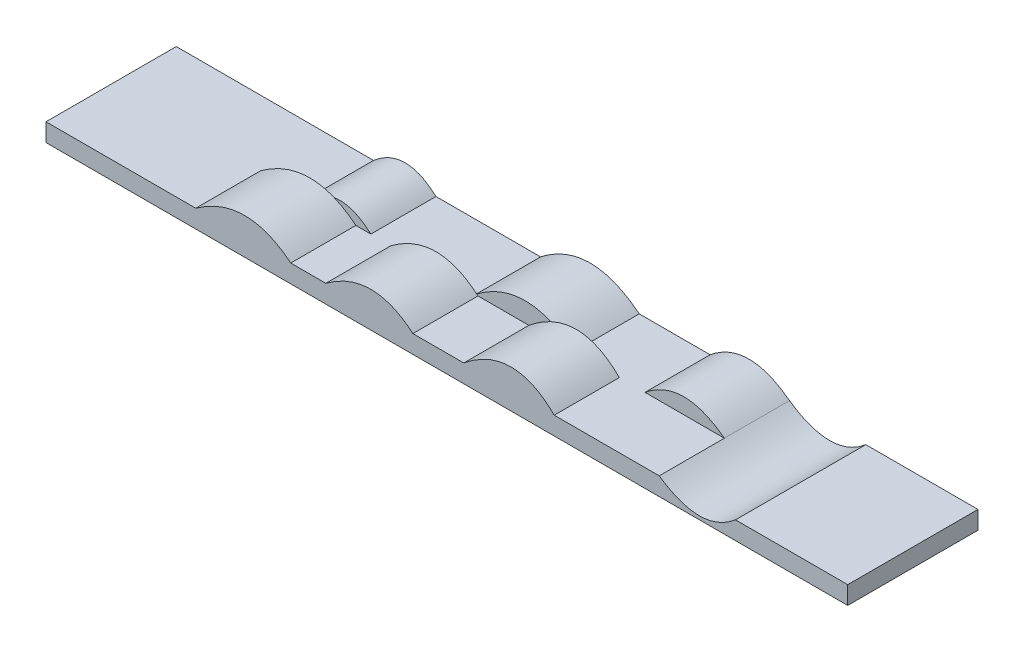
ISO-10303-21;
HEADER;
FILE_DESCRIPTION(('STEP AP214'),'2;1');
FILE_NAME('part.step','',(''),(''),'','','');
FILE_SCHEMA(('AUTOMOTIVE_DESIGN { 1 0 10303 214 1 1 1 1 }'));
ENDSEC;
DATA;
#1=APPLICATION_CONTEXT('core data for automotive mechanical design processes');
#2=APPLICATION_PROTOCOL_DEFINITION('international standard','automotive_design',2000,#1);
#3=PRODUCT_CONTEXT('',#1,'mechanical');
#4=PRODUCT('Part','Part','',(#3));
#5=PRODUCT_RELATED_PRODUCT_CATEGORY('part','',(#4));
#6=PRODUCT_DEFINITION_FORMATION('','',#4);
#7=PRODUCT_DEFINITION_CONTEXT('part definition',#1,'design');
#8=PRODUCT_DEFINITION('design','',#6,#7);
#9=PRODUCT_DEFINITION_SHAPE('','',#8);
#10=(LENGTH_UNIT() NAMED_UNIT(*) SI_UNIT(.MILLI.,.METRE.));
#11=(NAMED_UNIT(*) PLANE_ANGLE_UNIT() SI_UNIT($,.RADIAN.));
#12=(NAMED_UNIT(*) SI_UNIT($,.STERADIAN.) SOLID_ANGLE_UNIT());
#13=UNCERTAINTY_MEASURE_WITH_UNIT(LENGTH_MEASURE(1.E-05),#10,'distance_accuracy_value','');
#14=(GEOMETRIC_REPRESENTATION_CONTEXT(3) GLOBAL_UNCERTAINTY_ASSIGNED_CONTEXT((#13)) GLOBAL_UNIT_ASSIGNED_CONTEXT((#10,
#11,#12)) REPRESENTATION_CONTEXT('',''));
#15=CARTESIAN_POINT('',(0.,0.,0.));
#16=DIRECTION('',(0.,0.,1.));
#17=DIRECTION('',(1.,0.,0.));
#18=AXIS2_PLACEMENT_3D('',#15,#16,#17);
#19=CARTESIAN_POINT('',(0.,90.,0.));
#20=DIRECTION('',(0.,-1.,0.));
#21=DIRECTION('',(0.,0.,-1.));
#22=AXIS2_PLACEMENT_3D('',#19,#20,#21);
#23=PLANE('',#22);
#24=DIRECTION('',(-1.,0.,0.));
#25=VECTOR('',#24,1.);
#26=CARTESIAN_POINT('',(-2000.,90.,-325.));
#27=LINE('',#26,#25);
#28=CARTESIAN_POINT('',(2000.,90.,-325.));
#29=VERTEX_POINT('',#28);
#30=CARTESIAN_POINT('',(1440.18100709892,90.,-325.));
#31=VERTEX_POINT('',#30);
#32=EDGE_CURVE('E186',#29,#31,#27,.T.);
#33=ORIENTED_EDGE('',*,*,#32,.T.);
#34=DIRECTION('',(0.,0.,-1.));
#35=VECTOR('',#34,1.);
#36=CARTESIAN_POINT('',(1440.18100709892,90.,775.));
#37=LINE('',#36,#35);
#38=CARTESIAN_POINT('',(1440.18100709892,90.,325.));
#39=VERTEX_POINT('',#38);
#40=EDGE_CURVE('E170',#39,#31,#37,.T.);
#41=ORIENTED_EDGE('',*,*,#40,.F.);
#42=DIRECTION('',(1.,0.,0.));
#43=VECTOR('',#42,1.);
#44=CARTESIAN_POINT('',(-2000.,90.,325.));
#45=LINE('',#44,#43);
#46=CARTESIAN_POINT('',(2000.,90.,325.));
#47=VERTEX_POINT('',#46);
#48=EDGE_CURVE('E198',#39,#47,#45,.T.);
#49=ORIENTED_EDGE('',*,*,#48,.T.);
#50=DIRECTION('',(0.,0.,-1.));
#51=VECTOR('',#50,1.);
#52=CARTESIAN_POINT('',(2000.,90.,325.));
#53=LINE('',#52,#51);
#54=EDGE_CURVE('E192',#47,#29,#53,.T.);
#55=ORIENTED_EDGE('',*,*,#54,.T.);
#56=EDGE_LOOP('',(#33,#41,#49,#55));
#57=FACE_BOUND('',#56,.T.);
#58=ADVANCED_FACE('F36',(#57),#23,.F.);
#59=DIRECTION('',(0.,0.,-1.));
#60=VECTOR('',#59,1.);
#61=CARTESIAN_POINT('',(-1015.92929456039,90.,0.));
#62=LINE('',#61,#60);
#63=CARTESIAN_POINT('',(-1015.92929456039,90.,0.));
#64=VERTEX_POINT('',#63);
#65=CARTESIAN_POINT('',(-1015.92929456039,90.,-325.));
#66=VERTEX_POINT('',#65);
#67=EDGE_CURVE('E62',#64,#66,#62,.T.);
#68=ORIENTED_EDGE('',*,*,#67,.T.);
#69=CARTESIAN_POINT('',(-2000.,90.,-325.));
#70=VERTEX_POINT('',#69);
#71=EDGE_CURVE('E197',#66,#70,#27,.T.);
#72=ORIENTED_EDGE('',*,*,#71,.T.);
#73=DIRECTION('',(0.,0.,1.));
#74=VECTOR('',#73,1.);
#75=CARTESIAN_POINT('',(-2000.,90.,325.));
#76=LINE('',#75,#74);
#77=CARTESIAN_POINT('',(-2000.,90.,325.));
#78=VERTEX_POINT('',#77);
#79=EDGE_CURVE('E194',#70,#78,#76,.T.);
#80=ORIENTED_EDGE('',*,*,#79,.T.);
#81=CARTESIAN_POINT('',(-1252.9038315962,90.,325.));
#82=VERTEX_POINT('',#81);
#83=EDGE_CURVE('E622',#78,#82,#45,.T.);
#84=ORIENTED_EDGE('',*,*,#83,.T.);
#85=DIRECTION('',(0.,0.,1.));
#86=VECTOR('',#85,1.);
#87=CARTESIAN_POINT('',(-1252.9038315962,90.,0.));
#88=LINE('',#87,#86);
#89=CARTESIAN_POINT('',(-1252.9038315962,90.,0.));
#90=VERTEX_POINT('',#89);
#91=EDGE_CURVE('E207',#90,#82,#88,.T.);
#92=ORIENTED_EDGE('',*,*,#91,.F.);
#93=DIRECTION('',(-1.,0.,0.));
#94=VECTOR('',#93,1.);
#95=CARTESIAN_POINT('',(0.,90.,0.));
#96=LINE('',#95,#94);
#97=EDGE_CURVE('E211',#64,#90,#96,.T.);
#98=ORIENTED_EDGE('',*,*,#97,.F.);
#99=EDGE_LOOP('',(#68,#72,#80,#84,#92,#98));
#100=FACE_BOUND('',#99,.T.);
#101=ADVANCED_FACE('F268',(#100),#23,.F.);
#102=DIRECTION('',(0.,0.,-1.));
#103=VECTOR('',#102,1.);
#104=CARTESIAN_POINT('',(-704.262772847717,90.,0.));
#105=LINE('',#104,#103);
#106=CARTESIAN_POINT('',(-704.262772847717,90.,0.));
#107=VERTEX_POINT('',#106);
#108=CARTESIAN_POINT('',(-704.262772847717,90.,-325.));
#109=VERTEX_POINT('',#108);
#110=EDGE_CURVE('E54',#107,#109,#105,.T.);
#111=ORIENTED_EDGE('',*,*,#110,.F.);
#112=DIRECTION('',(1.,0.,0.));
#113=VECTOR('',#112,1.);
#114=CARTESIAN_POINT('',(0.,90.,0.));
#115=LINE('',#114,#113);
#116=CARTESIAN_POINT('',(-778.954757524579,90.,0.));
#117=VERTEX_POINT('',#116);
#118=EDGE_CURVE('E576',#117,#107,#115,.T.);
#119=ORIENTED_EDGE('',*,*,#118,.F.);
#120=DIRECTION('',(0.,0.,1.));
#121=VECTOR('',#120,1.);
#122=CARTESIAN_POINT('',(-778.954757524579,90.,0.));
#123=LINE('',#122,#121);
#124=CARTESIAN_POINT('',(-778.954757524579,90.,325.));
#125=VERTEX_POINT('',#124);
#126=EDGE_CURVE('E210',#117,#125,#123,.T.);
#127=ORIENTED_EDGE('',*,*,#126,.T.);
#128=CARTESIAN_POINT('',(-604.044980188625,90.,325.));
#129=VERTEX_POINT('',#128);
#130=EDGE_CURVE('E626',#125,#129,#45,.T.);
#131=ORIENTED_EDGE('',*,*,#130,.T.);
#132=DIRECTION('',(0.,0.,1.));
#133=VECTOR('',#132,1.);
#134=CARTESIAN_POINT('',(-604.044980188625,90.,0.));
#135=LINE('',#134,#133);
#136=CARTESIAN_POINT('',(-604.044980188625,90.,0.));
#137=VERTEX_POINT('',#136);
#138=EDGE_CURVE('E231',#137,#129,#135,.T.);
#139=ORIENTED_EDGE('',*,*,#138,.F.);
#140=DIRECTION('',(-1.,0.,0.));
#141=VECTOR('',#140,1.);
#142=CARTESIAN_POINT('',(0.,90.,0.));
#143=LINE('',#142,#141);
#144=CARTESIAN_POINT('',(-182.316456227787,90.,0.));
#145=VERTEX_POINT('',#144);
#146=EDGE_CURVE('E377',#145,#137,#143,.T.);
#147=ORIENTED_EDGE('',*,*,#146,.F.);
#148=DIRECTION('',(0.,0.,-1.));
#149=VECTOR('',#148,1.);
#150=CARTESIAN_POINT('',(-182.316456227787,90.,0.));
#151=LINE('',#150,#149);
#152=CARTESIAN_POINT('',(-182.316456227787,90.,-325.));
#153=VERTEX_POINT('',#152);
#154=EDGE_CURVE('E313',#145,#153,#151,.T.);
#155=ORIENTED_EDGE('',*,*,#154,.T.);
#156=EDGE_CURVE('E200',#153,#109,#27,.T.);
#157=ORIENTED_EDGE('',*,*,#156,.T.);
#158=EDGE_LOOP('',(#111,#119,#127,#131,#139,#147,#155,#157));
#159=FACE_BOUND('',#158,.T.);
#160=ADVANCED_FACE('F272',(#159),#23,.F.);
#161=CARTESIAN_POINT('',(0.,0.,0.));
#162=DIRECTION('',(0.,0.,1.));
#163=DIRECTION('',(1.,0.,0.));
#164=AXIS2_PLACEMENT_3D('',#161,#162,#163);
#165=PLANE('',#164);
#166=CARTESIAN_POINT('',(-704.262772847717,90.,0.));
#167=CARTESIAN_POINT('',(-855.87881609719,227.081429678862,0.));
#168=CARTESIAN_POINT('',(-1015.92929456039,90.,0.));
#169=B_SPLINE_CURVE_WITH_KNOTS('',2,(#166,#167,#168),.UNSPECIFIED.,.F.,.F.,(3,3),(0.,1.),.UNSPECIFIED.);
#170=CARTESIAN_POINT('',(-887.402677157012,156.11095470375,0.));
#171=VERTEX_POINT('',#170);
#172=EDGE_CURVE('E11',#64,#171,#169,.F.);
#173=ORIENTED_EDGE('',*,*,#172,.F.);
#174=ORIENTED_EDGE('',*,*,#97,.T.);
#175=CARTESIAN_POINT('',(-1252.9038315962,90.,0.));
#176=CARTESIAN_POINT('',(-1001.8032786459,271.390478836697,0.));
#177=CARTESIAN_POINT('',(-778.954757524579,89.9999999999998,0.));
#178=B_SPLINE_CURVE_WITH_KNOTS('',2,(#175,#176,#177),.UNSPECIFIED.,.F.,.F.,(3,3),(0.,1.),.UNSPECIFIED.);
#179=EDGE_CURVE('E226',#90,#171,#178,.T.);
#180=ORIENTED_EDGE('',*,*,#179,.T.);
#181=EDGE_LOOP('',(#173,#174,#180));
#182=FACE_BOUND('',#181,.T.);
#183=ADVANCED_FACE('F244',(#182),#165,.F.);
#184=CARTESIAN_POINT('',(535.68969793599,90.,325.));
#185=VERTEX_POINT('',#184);
#186=CARTESIAN_POINT('',(1059.68718769993,90.,325.));
#187=VERTEX_POINT('',#186);
#188=EDGE_CURVE('E633',#185,#187,#45,.T.);
#189=ORIENTED_EDGE('',*,*,#188,.T.);
#190=DIRECTION('',(0.,0.,-1.));
#191=VECTOR('',#190,1.);
#192=CARTESIAN_POINT('',(1059.68718769993,90.,775.));
#193=LINE('',#192,#191);
#194=CARTESIAN_POINT('',(1059.68718769993,90.,0.));
#195=VERTEX_POINT('',#194);
#196=EDGE_CURVE('E180',#187,#195,#193,.T.);
#197=ORIENTED_EDGE('',*,*,#196,.T.);
#198=DIRECTION('',(1.,0.,0.));
#199=VECTOR('',#198,1.);
#200=CARTESIAN_POINT('',(0.,90.,0.));
#201=LINE('',#200,#199);
#202=CARTESIAN_POINT('',(663.465166324216,90.,0.));
#203=VERTEX_POINT('',#202);
#204=EDGE_CURVE('E650',#203,#195,#201,.T.);
#205=ORIENTED_EDGE('',*,*,#204,.F.);
#206=DIRECTION('',(0.,0.,-1.));
#207=VECTOR('',#206,1.);
#208=CARTESIAN_POINT('',(663.465166324216,90.,0.));
#209=LINE('',#208,#207);
#210=CARTESIAN_POINT('',(663.465166324216,90.,-325.));
#211=VERTEX_POINT('',#210);
#212=EDGE_CURVE('E355',#203,#211,#209,.T.);
#213=ORIENTED_EDGE('',*,*,#212,.T.);
#214=CARTESIAN_POINT('',(309.999662663789,90.,-325.));
#215=VERTEX_POINT('',#214);
#216=EDGE_CURVE('E195',#211,#215,#27,.T.);
#217=ORIENTED_EDGE('',*,*,#216,.T.);
#218=DIRECTION('',(0.,0.,-1.));
#219=VECTOR('',#218,1.);
#220=CARTESIAN_POINT('',(309.999662663789,90.,0.));
#221=LINE('',#220,#219);
#222=CARTESIAN_POINT('',(309.999662663789,90.,0.));
#223=VERTEX_POINT('',#222);
#224=EDGE_CURVE('E299',#223,#215,#221,.T.);
#225=ORIENTED_EDGE('',*,*,#224,.F.);
#226=DIRECTION('',(-1.,0.,0.));
#227=VECTOR('',#226,1.);
#228=CARTESIAN_POINT('',(0.,90.,0.));
#229=LINE('',#228,#227);
#230=CARTESIAN_POINT('',(535.68969793599,90.,0.));
#231=VERTEX_POINT('',#230);
#232=EDGE_CURVE('E353',#231,#223,#229,.T.);
#233=ORIENTED_EDGE('',*,*,#232,.F.);
#234=DIRECTION('',(0.,0.,1.));
#235=VECTOR('',#234,1.);
#236=CARTESIAN_POINT('',(535.68969793599,90.,0.));
#237=LINE('',#236,#235);
#238=EDGE_CURVE('E365',#231,#185,#237,.T.);
#239=ORIENTED_EDGE('',*,*,#238,.T.);
#240=EDGE_LOOP('',(#189,#197,#205,#213,#217,#225,#233,#239));
#241=FACE_BOUND('',#240,.T.);
#242=ADVANCED_FACE('F246',(#241),#23,.F.);
#243=DIRECTION('',(1.,0.,0.));
#244=VECTOR('',#243,1.);
#245=CARTESIAN_POINT('',(0.,90.,0.));
#246=LINE('',#245,#244);
#247=CARTESIAN_POINT('',(-169.591662289638,90.,0.));
#248=VERTEX_POINT('',#247);
#249=CARTESIAN_POINT('',(84.3096273915886,90.,0.));
#250=VERTEX_POINT('',#249);
#251=EDGE_CURVE('E290',#248,#250,#246,.T.);
#252=ORIENTED_EDGE('',*,*,#251,.F.);
#253=DIRECTION('',(0.,0.,1.));
#254=VECTOR('',#253,1.);
#255=CARTESIAN_POINT('',(-169.591662289638,90.,0.));
#256=LINE('',#255,#254);
#257=CARTESIAN_POINT('',(-169.591662289638,90.,325.));
#258=VERTEX_POINT('',#257);
#259=EDGE_CURVE('E221',#248,#258,#256,.T.);
#260=ORIENTED_EDGE('',*,*,#259,.T.);
#261=CARTESIAN_POINT('',(84.3096273915886,90.,325.));
#262=VERTEX_POINT('',#261);
#263=EDGE_CURVE('E631',#258,#262,#45,.T.);
#264=ORIENTED_EDGE('',*,*,#263,.T.);
#265=DIRECTION('',(0.,0.,1.));
#266=VECTOR('',#265,1.);
#267=CARTESIAN_POINT('',(84.3096273915886,90.,0.));
#268=LINE('',#267,#266);
#269=EDGE_CURVE('E294',#250,#262,#268,.T.);
#270=ORIENTED_EDGE('',*,*,#269,.F.);
#271=EDGE_LOOP('',(#252,#260,#264,#270));
#272=FACE_BOUND('',#271,.T.);
#273=ADVANCED_FACE('F249',(#272),#23,.F.);
#274=CARTESIAN_POINT('',(0.,0.,0.));
#275=DIRECTION('',(0.,0.,1.));
#276=DIRECTION('',(1.,0.,0.));
#277=AXIS2_PLACEMENT_3D('',#274,#275,#276);
#278=PLANE('',#277);
#279=CARTESIAN_POINT('',(309.999662663789,90.,0.));
#280=CARTESIAN_POINT('',(66.3474731197513,284.541836271489,0.));
#281=CARTESIAN_POINT('',(-182.316456227787,89.9999999999999,0.));
#282=B_SPLINE_CURVE_WITH_KNOTS('',2,(#279,#280,#281),.UNSPECIFIED.,.F.,.F.,(3,3),(0.,1.),.UNSPECIFIED.);
#283=CARTESIAN_POINT('',(-175.674451927689,95.127643137007,0.));
#284=VERTEX_POINT('',#283);
#285=EDGE_CURVE('E586',#284,#145,#282,.T.);
#286=ORIENTED_EDGE('',*,*,#285,.T.);
#287=ORIENTED_EDGE('',*,*,#146,.T.);
#288=CARTESIAN_POINT('',(-604.044980188625,90.,0.));
#289=CARTESIAN_POINT('',(-371.482358129875,262.986446505385,0.));
#290=CARTESIAN_POINT('',(-169.591662289638,90.,0.));
#291=B_SPLINE_CURVE_WITH_KNOTS('',2,(#288,#289,#290),.UNSPECIFIED.,.F.,.F.,(3,3),(0.,1.),.UNSPECIFIED.);
#292=EDGE_CURVE('E372',#137,#284,#291,.T.);
#293=ORIENTED_EDGE('',*,*,#292,.T.);
#294=EDGE_LOOP('',(#286,#287,#293));
#295=FACE_BOUND('',#294,.T.);
#296=ADVANCED_FACE('F281',(#295),#278,.F.);
#297=CARTESIAN_POINT('',(0.,0.,0.));
#298=DIRECTION('',(0.,0.,1.));
#299=DIRECTION('',(1.,0.,0.));
#300=AXIS2_PLACEMENT_3D('',#297,#298,#299);
#301=PLANE('',#300);
#302=CARTESIAN_POINT('',(193.685994284878,160.58402984898,0.));
#303=VERTEX_POINT('',#302);
#304=EDGE_CURVE('E300',#223,#303,#282,.T.);
#305=ORIENTED_EDGE('',*,*,#304,.T.);
#306=CARTESIAN_POINT('',(84.3096273915886,90.,0.));
#307=CARTESIAN_POINT('',(330.413191864697,291.459655472045,0.));
#308=CARTESIAN_POINT('',(535.68969793599,89.9999999999998,0.));
#309=B_SPLINE_CURVE_WITH_KNOTS('',2,(#306,#307,#308),.UNSPECIFIED.,.F.,.F.,(3,3),(0.,1.),.UNSPECIFIED.);
#310=EDGE_CURVE('E354',#303,#231,#309,.T.);
#311=ORIENTED_EDGE('',*,*,#310,.T.);
#312=ORIENTED_EDGE('',*,*,#232,.T.);
#313=EDGE_LOOP('',(#305,#311,#312));
#314=FACE_BOUND('',#313,.T.);
#315=ADVANCED_FACE('F265',(#314),#301,.F.);
#316=CARTESIAN_POINT('',(2000.,90.,325.));
#317=DIRECTION('',(-1.,0.,0.));
#318=DIRECTION('',(0.,0.,1.));
#319=AXIS2_PLACEMENT_3D('',#316,#317,#318);
#320=PLANE('',#319);
#321=DIRECTION('',(0.,0.,-1.));
#322=VECTOR('',#321,1.);
#323=CARTESIAN_POINT('',(2000.,0.,325.));
#324=LINE('',#323,#322);
#325=CARTESIAN_POINT('',(2000.,0.,325.));
#326=VERTEX_POINT('',#325);
#327=CARTESIAN_POINT('',(2000.,0.,-325.));
#328=VERTEX_POINT('',#327);
#329=EDGE_CURVE('E214',#326,#328,#324,.T.);
#330=ORIENTED_EDGE('',*,*,#329,.T.);
#331=DIRECTION('',(0.,-1.,0.));
#332=VECTOR('',#331,1.);
#333=CARTESIAN_POINT('',(2000.,90.,-325.));
#334=LINE('',#333,#332);
#335=EDGE_CURVE('E46',#29,#328,#334,.T.);
#336=ORIENTED_EDGE('',*,*,#335,.F.);
#337=ORIENTED_EDGE('',*,*,#54,.F.);
#338=DIRECTION('',(0.,-1.,0.));
#339=VECTOR('',#338,1.);
#340=CARTESIAN_POINT('',(2000.,90.,325.));
#341=LINE('',#340,#339);
#342=EDGE_CURVE('E625',#47,#326,#341,.T.);
#343=ORIENTED_EDGE('',*,*,#342,.T.);
#344=EDGE_LOOP('',(#330,#336,#337,#343));
#345=FACE_BOUND('',#344,.T.);
#346=ADVANCED_FACE('F38',(#345),#320,.F.);
#347=CARTESIAN_POINT('',(-2000.,90.,-325.));
#348=DIRECTION('',(0.,0.,1.));
#349=DIRECTION('',(1.,0.,0.));
#350=AXIS2_PLACEMENT_3D('',#347,#348,#349);
#351=PLANE('',#350);
#352=CARTESIAN_POINT('',(1059.68718769993,90.,-325.));
#353=CARTESIAN_POINT('',(853.762409995938,246.421021522043,-325.));
#354=CARTESIAN_POINT('',(663.465166324216,90.,-325.));
#355=B_SPLINE_CURVE_WITH_KNOTS('',2,(#352,#353,#354),.UNSPECIFIED.,.F.,.F.,(3,3),(0.,1.),.UNSPECIFIED.);
#356=CARTESIAN_POINT('',(1059.68718769993,90.,-325.));
#357=VERTEX_POINT('',#356);
#358=EDGE_CURVE('E189',#357,#211,#355,.T.);
#359=ORIENTED_EDGE('',*,*,#358,.F.);
#360=CARTESIAN_POINT('',(1440.18100709892,90.,-325.));
#361=CARTESIAN_POINT('',(1269.42420186536,-55.0726316013505,-325.));
#362=CARTESIAN_POINT('',(1059.68718769993,90.,-325.));
#363=B_SPLINE_CURVE_WITH_KNOTS('',2,(#360,#361,#362),.UNSPECIFIED.,.F.,.F.,(3,3),(0.,1.),.UNSPECIFIED.);
#364=EDGE_CURVE('E173',#31,#357,#363,.T.);
#365=ORIENTED_EDGE('',*,*,#364,.F.);
#366=ORIENTED_EDGE('',*,*,#32,.F.);
#367=ORIENTED_EDGE('',*,*,#335,.T.);
#368=DIRECTION('',(-1.,0.,0.));
#369=VECTOR('',#368,1.);
#370=CARTESIAN_POINT('',(-2000.,0.,-325.));
#371=LINE('',#370,#369);
#372=CARTESIAN_POINT('',(-2000.,0.,-325.));
#373=VERTEX_POINT('',#372);
#374=EDGE_CURVE('E614',#328,#373,#371,.T.);
#375=ORIENTED_EDGE('',*,*,#374,.T.);
#376=DIRECTION('',(0.,-1.,0.));
#377=VECTOR('',#376,1.);
#378=CARTESIAN_POINT('',(-2000.,90.,-325.));
#379=LINE('',#378,#377);
#380=EDGE_CURVE('E612',#70,#373,#379,.T.);
#381=ORIENTED_EDGE('',*,*,#380,.F.);
#382=ORIENTED_EDGE('',*,*,#71,.F.);
#383=CARTESIAN_POINT('',(-704.262772847717,90.,-325.));
#384=CARTESIAN_POINT('',(-855.87881609719,227.081429678862,-325.));
#385=CARTESIAN_POINT('',(-1015.92929456039,90.,-325.));
#386=B_SPLINE_CURVE_WITH_KNOTS('',2,(#383,#384,#385),.UNSPECIFIED.,.F.,.F.,(3,3),(0.,1.),.UNSPECIFIED.);
#387=EDGE_CURVE('E566',#109,#66,#386,.T.);
#388=ORIENTED_EDGE('',*,*,#387,.F.);
#389=ORIENTED_EDGE('',*,*,#156,.F.);
#390=CARTESIAN_POINT('',(309.999662663789,90.,-325.));
#391=CARTESIAN_POINT('',(66.3474731197513,284.541836271489,-325.));
#392=CARTESIAN_POINT('',(-182.316456227787,89.9999999999999,-325.));
#393=B_SPLINE_CURVE_WITH_KNOTS('',2,(#390,#391,#392),.UNSPECIFIED.,.F.,.F.,(3,3),(0.,1.),.UNSPECIFIED.);
#394=EDGE_CURVE('E592',#215,#153,#393,.T.);
#395=ORIENTED_EDGE('',*,*,#394,.F.);
#396=ORIENTED_EDGE('',*,*,#216,.F.);
#397=EDGE_LOOP('',(#359,#365,#366,#367,#375,#381,#382,#388,#389,#395,#396));
#398=FACE_BOUND('',#397,.T.);
#399=ADVANCED_FACE('F184',(#398),#351,.F.);
#400=CARTESIAN_POINT('',(-2000.,90.,325.));
#401=DIRECTION('',(1.,0.,0.));
#402=DIRECTION('',(0.,0.,-1.));
#403=AXIS2_PLACEMENT_3D('',#400,#401,#402);
#404=PLANE('',#403);
#405=DIRECTION('',(0.,0.,1.));
#406=VECTOR('',#405,1.);
#407=CARTESIAN_POINT('',(-2000.,0.,325.));
#408=LINE('',#407,#406);
#409=CARTESIAN_POINT('',(-2000.,0.,325.));
#410=VERTEX_POINT('',#409);
#411=EDGE_CURVE('E204',#373,#410,#408,.T.);
#412=ORIENTED_EDGE('',*,*,#411,.T.);
#413=DIRECTION('',(0.,-1.,0.));
#414=VECTOR('',#413,1.);
#415=CARTESIAN_POINT('',(-2000.,90.,325.));
#416=LINE('',#415,#414);
#417=EDGE_CURVE('E616',#78,#410,#416,.T.);
#418=ORIENTED_EDGE('',*,*,#417,.F.);
#419=ORIENTED_EDGE('',*,*,#79,.F.);
#420=ORIENTED_EDGE('',*,*,#380,.T.);
#421=EDGE_LOOP('',(#412,#418,#419,#420));
#422=FACE_BOUND('',#421,.T.);
#423=ADVANCED_FACE('F257',(#422),#404,.F.);
#424=CARTESIAN_POINT('',(-2000.,90.,325.));
#425=DIRECTION('',(0.,0.,-1.));
#426=DIRECTION('',(-1.,0.,0.));
#427=AXIS2_PLACEMENT_3D('',#424,#425,#426);
#428=PLANE('',#427);
#429=ORIENTED_EDGE('',*,*,#48,.F.);
#430=CARTESIAN_POINT('',(1440.18100709892,90.,325.));
#431=CARTESIAN_POINT('',(1269.42420186536,-55.0726316013505,325.));
#432=CARTESIAN_POINT('',(1059.68718769993,90.,325.));
#433=B_SPLINE_CURVE_WITH_KNOTS('',2,(#430,#431,#432),.UNSPECIFIED.,.F.,.F.,(3,3),(0.,1.),.UNSPECIFIED.);
#434=EDGE_CURVE('E176',#39,#187,#433,.T.);
#435=ORIENTED_EDGE('',*,*,#434,.T.);
#436=ORIENTED_EDGE('',*,*,#188,.F.);
#437=CARTESIAN_POINT('',(84.3096273915886,90.,325.));
#438=CARTESIAN_POINT('',(330.413191864697,291.459655472045,325.));
#439=CARTESIAN_POINT('',(535.68969793599,89.9999999999998,325.));
#440=B_SPLINE_CURVE_WITH_KNOTS('',2,(#437,#438,#439),.UNSPECIFIED.,.F.,.F.,(3,3),(0.,1.),.UNSPECIFIED.);
#441=EDGE_CURVE('E360',#262,#185,#440,.T.);
#442=ORIENTED_EDGE('',*,*,#441,.F.);
#443=ORIENTED_EDGE('',*,*,#263,.F.);
#444=CARTESIAN_POINT('',(-604.044980188625,90.,325.));
#445=CARTESIAN_POINT('',(-371.482358129875,262.986446505385,325.));
#446=CARTESIAN_POINT('',(-169.591662289638,90.,325.));
#447=B_SPLINE_CURVE_WITH_KNOTS('',2,(#444,#445,#446),.UNSPECIFIED.,.F.,.F.,(3,3),(0.,1.),.UNSPECIFIED.);
#448=EDGE_CURVE('E308',#129,#258,#447,.T.);
#449=ORIENTED_EDGE('',*,*,#448,.F.);
#450=ORIENTED_EDGE('',*,*,#130,.F.);
#451=CARTESIAN_POINT('',(-1252.9038315962,90.,325.));
#452=CARTESIAN_POINT('',(-1001.8032786459,271.390478836697,325.));
#453=CARTESIAN_POINT('',(-778.954757524579,89.9999999999998,325.));
#454=B_SPLINE_CURVE_WITH_KNOTS('',2,(#451,#452,#453),.UNSPECIFIED.,.F.,.F.,(3,3),(0.,1.),.UNSPECIFIED.);
#455=EDGE_CURVE('E215',#82,#125,#454,.T.);
#456=ORIENTED_EDGE('',*,*,#455,.F.);
#457=ORIENTED_EDGE('',*,*,#83,.F.);
#458=ORIENTED_EDGE('',*,*,#417,.T.);
#459=DIRECTION('',(1.,0.,0.));
#460=VECTOR('',#459,1.);
#461=CARTESIAN_POINT('',(-2000.,0.,325.));
#462=LINE('',#461,#460);
#463=EDGE_CURVE('E203',#410,#326,#462,.T.);
#464=ORIENTED_EDGE('',*,*,#463,.T.);
#465=ORIENTED_EDGE('',*,*,#342,.F.);
#466=EDGE_LOOP('',(#429,#435,#436,#442,#443,#449,#450,#456,#457,#458,#464,#465));
#467=FACE_BOUND('',#466,.T.);
#468=ADVANCED_FACE('F253',(#467),#428,.F.);
#469=CARTESIAN_POINT('',(0.,0.,0.));
#470=DIRECTION('',(0.,-1.,0.));
#471=DIRECTION('',(0.,0.,-1.));
#472=AXIS2_PLACEMENT_3D('',#469,#470,#471);
#473=PLANE('',#472);
#474=ORIENTED_EDGE('',*,*,#329,.F.);
#475=ORIENTED_EDGE('',*,*,#463,.F.);
#476=ORIENTED_EDGE('',*,*,#411,.F.);
#477=ORIENTED_EDGE('',*,*,#374,.F.);
#478=EDGE_LOOP('',(#474,#475,#476,#477));
#479=FACE_BOUND('',#478,.T.);
#480=ADVANCED_FACE('F242',(#479),#473,.T.);
#481=DIRECTION('',(0.,0.,1.));
#482=VECTOR('',#481,1.);
#483=SURFACE_OF_LINEAR_EXTRUSION('',#178,#482);
#484=ORIENTED_EDGE('',*,*,#455,.T.);
#485=ORIENTED_EDGE('',*,*,#126,.F.);
#486=EDGE_CURVE('E220',#171,#117,#178,.T.);
#487=ORIENTED_EDGE('',*,*,#486,.F.);
#488=ORIENTED_EDGE('',*,*,#179,.F.);
#489=ORIENTED_EDGE('',*,*,#91,.T.);
#490=EDGE_LOOP('',(#484,#485,#487,#488,#489));
#491=FACE_BOUND('',#490,.T.);
#492=ADVANCED_FACE('F237',(#491),#483,.F.);
#493=DIRECTION('',(0.,0.,1.));
#494=VECTOR('',#493,1.);
#495=SURFACE_OF_LINEAR_EXTRUSION('',#291,#494);
#496=ORIENTED_EDGE('',*,*,#448,.T.);
#497=ORIENTED_EDGE('',*,*,#259,.F.);
#498=CARTESIAN_POINT('',(-604.044980188625,90.,0.));
#499=CARTESIAN_POINT('',(-371.482358129875,262.986446505385,0.));
#500=CARTESIAN_POINT('',(-169.591662289638,90.,0.));
#501=B_SPLINE_CURVE_WITH_KNOTS('',2,(#498,#499,#500),.UNSPECIFIED.,.F.,.F.,(3,3),(0.,1.),.UNSPECIFIED.);
#502=EDGE_CURVE('E304',#284,#248,#501,.T.);
#503=ORIENTED_EDGE('',*,*,#502,.F.);
#504=ORIENTED_EDGE('',*,*,#292,.F.);
#505=ORIENTED_EDGE('',*,*,#138,.T.);
#506=EDGE_LOOP('',(#496,#497,#503,#504,#505));
#507=FACE_BOUND('',#506,.T.);
#508=ADVANCED_FACE('F241',(#507),#495,.F.);
#509=DIRECTION('',(0.,0.,1.));
#510=VECTOR('',#509,1.);
#511=SURFACE_OF_LINEAR_EXTRUSION('',#309,#510);
#512=ORIENTED_EDGE('',*,*,#441,.T.);
#513=ORIENTED_EDGE('',*,*,#238,.F.);
#514=ORIENTED_EDGE('',*,*,#310,.F.);
#515=EDGE_CURVE('E348',#250,#303,#309,.T.);
#516=ORIENTED_EDGE('',*,*,#515,.F.);
#517=ORIENTED_EDGE('',*,*,#269,.T.);
#518=EDGE_LOOP('',(#512,#513,#514,#516,#517));
#519=FACE_BOUND('',#518,.T.);
#520=ADVANCED_FACE('F339',(#519),#511,.F.);
#521=CARTESIAN_POINT('',(1059.68718769993,90.,0.));
#522=CARTESIAN_POINT('',(853.762409995938,246.421021522043,0.));
#523=CARTESIAN_POINT('',(663.465166324216,90.,0.));
#524=B_SPLINE_CURVE_WITH_KNOTS('',2,(#521,#522,#523),.UNSPECIFIED.,.F.,.F.,(3,3),(0.,1.),.UNSPECIFIED.);
#525=DIRECTION('',(0.,0.,-1.));
#526=VECTOR('',#525,1.);
#527=SURFACE_OF_LINEAR_EXTRUSION('',#524,#526);
#528=ORIENTED_EDGE('',*,*,#358,.T.);
#529=ORIENTED_EDGE('',*,*,#212,.F.);
#530=EDGE_CURVE('E40',#195,#203,#524,.T.);
#531=ORIENTED_EDGE('',*,*,#530,.F.);
#532=DIRECTION('',(0.,0.,-1.));
#533=VECTOR('',#532,1.);
#534=CARTESIAN_POINT('',(1059.68718769993,90.,0.));
#535=LINE('',#534,#533);
#536=EDGE_CURVE('E645',#195,#357,#535,.T.);
#537=ORIENTED_EDGE('',*,*,#536,.T.);
#538=EDGE_LOOP('',(#528,#529,#531,#537));
#539=FACE_BOUND('',#538,.T.);
#540=ADVANCED_FACE('F334',(#539),#527,.F.);
#541=CARTESIAN_POINT('',(0.,0.,0.));
#542=DIRECTION('',(0.,0.,-1.));
#543=DIRECTION('',(-1.,0.,0.));
#544=AXIS2_PLACEMENT_3D('',#541,#542,#543);
#545=PLANE('',#544);
#546=ORIENTED_EDGE('',*,*,#530,.T.);
#547=ORIENTED_EDGE('',*,*,#204,.T.);
#548=EDGE_LOOP('',(#546,#547));
#549=FACE_BOUND('',#548,.T.);
#550=ADVANCED_FACE('F338',(#549),#545,.F.);
#551=CARTESIAN_POINT('',(0.,0.,0.));
#552=DIRECTION('',(0.,0.,-1.));
#553=DIRECTION('',(-1.,0.,0.));
#554=AXIS2_PLACEMENT_3D('',#551,#552,#553);
#555=PLANE('',#554);
#556=EDGE_CURVE('E312',#303,#284,#282,.T.);
#557=ORIENTED_EDGE('',*,*,#556,.T.);
#558=ORIENTED_EDGE('',*,*,#502,.T.);
#559=ORIENTED_EDGE('',*,*,#251,.T.);
#560=ORIENTED_EDGE('',*,*,#515,.T.);
#561=EDGE_LOOP('',(#557,#558,#559,#560));
#562=FACE_BOUND('',#561,.T.);
#563=ADVANCED_FACE('F310',(#562),#555,.F.);
#564=DIRECTION('',(0.,0.,-1.));
#565=VECTOR('',#564,1.);
#566=SURFACE_OF_LINEAR_EXTRUSION('',#282,#565);
#567=ORIENTED_EDGE('',*,*,#394,.T.);
#568=ORIENTED_EDGE('',*,*,#154,.F.);
#569=ORIENTED_EDGE('',*,*,#285,.F.);
#570=ORIENTED_EDGE('',*,*,#556,.F.);
#571=ORIENTED_EDGE('',*,*,#304,.F.);
#572=ORIENTED_EDGE('',*,*,#224,.T.);
#573=EDGE_LOOP('',(#567,#568,#569,#570,#571,#572));
#574=FACE_BOUND('',#573,.T.);
#575=ADVANCED_FACE('F409',(#574),#566,.F.);
#576=CARTESIAN_POINT('',(0.,0.,0.));
#577=DIRECTION('',(0.,0.,-1.));
#578=DIRECTION('',(-1.,0.,0.));
#579=AXIS2_PLACEMENT_3D('',#576,#577,#578);
#580=PLANE('',#579);
#581=CARTESIAN_POINT('',(-704.262772847717,90.,0.));
#582=CARTESIAN_POINT('',(-855.87881609719,227.081429678862,0.));
#583=CARTESIAN_POINT('',(-1015.92929456039,90.,0.));
#584=B_SPLINE_CURVE_WITH_KNOTS('',2,(#581,#582,#583),.UNSPECIFIED.,.F.,.F.,(3,3),(0.,1.),.UNSPECIFIED.);
#585=EDGE_CURVE('E567',#107,#171,#584,.T.);
#586=ORIENTED_EDGE('',*,*,#585,.T.);
#587=ORIENTED_EDGE('',*,*,#486,.T.);
#588=ORIENTED_EDGE('',*,*,#118,.T.);
#589=EDGE_LOOP('',(#586,#587,#588));
#590=FACE_BOUND('',#589,.T.);
#591=ADVANCED_FACE('F416',(#590),#580,.F.);
#592=DIRECTION('',(0.,0.,-1.));
#593=VECTOR('',#592,1.);
#594=SURFACE_OF_LINEAR_EXTRUSION('',#584,#593);
#595=ORIENTED_EDGE('',*,*,#387,.T.);
#596=ORIENTED_EDGE('',*,*,#67,.F.);
#597=ORIENTED_EDGE('',*,*,#172,.T.);
#598=ORIENTED_EDGE('',*,*,#585,.F.);
#599=ORIENTED_EDGE('',*,*,#110,.T.);
#600=EDGE_LOOP('',(#595,#596,#597,#598,#599));
#601=FACE_BOUND('',#600,.T.);
#602=ADVANCED_FACE('F423',(#601),#594,.F.);
#603=CARTESIAN_POINT('',(1440.18100709892,90.,775.));
#604=CARTESIAN_POINT('',(1269.42420186536,-55.0726316013505,775.));
#605=CARTESIAN_POINT('',(1059.68718769993,90.,775.));
#606=B_SPLINE_CURVE_WITH_KNOTS('',2,(#603,#604,#605),.UNSPECIFIED.,.F.,.F.,(3,3),(0.,1.),.UNSPECIFIED.);
#607=DIRECTION('',(0.,0.,-1.));
#608=VECTOR('',#607,1.);
#609=SURFACE_OF_LINEAR_EXTRUSION('',#606,#608);
#610=ORIENTED_EDGE('',*,*,#40,.T.);
#611=ORIENTED_EDGE('',*,*,#364,.T.);
#612=ORIENTED_EDGE('',*,*,#536,.F.);
#613=ORIENTED_EDGE('',*,*,#196,.F.);
#614=ORIENTED_EDGE('',*,*,#434,.F.);
#615=EDGE_LOOP('',(#610,#611,#612,#613,#614));
#616=FACE_BOUND('',#615,.T.);
#617=ADVANCED_FACE('F172',(#616),#609,.F.);
#618=CLOSED_SHELL('',(#58,#101,#160,#183,#242,#273,#296,#315,#346,#399,#423,#468,#480,#492,#508,
#520,#540,#550,#563,#575,#591,#602,#617));
#619=MANIFOLD_SOLID_BREP('B2',#618);
#620=ADVANCED_BREP_SHAPE_REPRESENTATION('',(#18,#619),#14);
#621=SHAPE_DEFINITION_REPRESENTATION(#9,#620);
ENDSEC;
END-ISO-10303-21;
